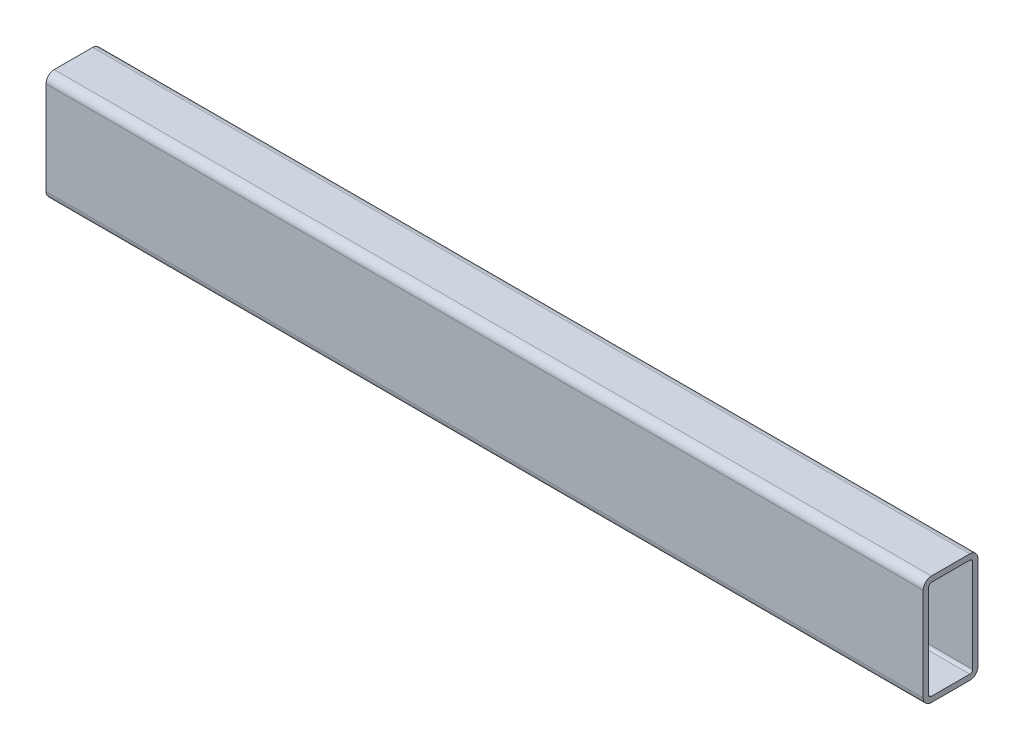
ISO-10303-21;
HEADER;
FILE_DESCRIPTION(('STEP AP214'),'2;1');
FILE_NAME('part.step','',(''),(''),'','','');
FILE_SCHEMA(('AUTOMOTIVE_DESIGN { 1 0 10303 214 1 1 1 1 }'));
ENDSEC;
DATA;
#1=APPLICATION_CONTEXT('core data for automotive mechanical design processes');
#2=APPLICATION_PROTOCOL_DEFINITION('international standard','automotive_design',2000,#1);
#3=PRODUCT_CONTEXT('',#1,'mechanical');
#4=PRODUCT('Part','Part','',(#3));
#5=PRODUCT_RELATED_PRODUCT_CATEGORY('part','',(#4));
#6=PRODUCT_DEFINITION_FORMATION('','',#4);
#7=PRODUCT_DEFINITION_CONTEXT('part definition',#1,'design');
#8=PRODUCT_DEFINITION('design','',#6,#7);
#9=PRODUCT_DEFINITION_SHAPE('','',#8);
#10=(LENGTH_UNIT() NAMED_UNIT(*) SI_UNIT(.MILLI.,.METRE.));
#11=(NAMED_UNIT(*) PLANE_ANGLE_UNIT() SI_UNIT($,.RADIAN.));
#12=(NAMED_UNIT(*) SI_UNIT($,.STERADIAN.) SOLID_ANGLE_UNIT());
#13=UNCERTAINTY_MEASURE_WITH_UNIT(LENGTH_MEASURE(1.E-05),#10,'distance_accuracy_value','');
#14=(GEOMETRIC_REPRESENTATION_CONTEXT(3) GLOBAL_UNCERTAINTY_ASSIGNED_CONTEXT((#13)) GLOBAL_UNIT_ASSIGNED_CONTEXT((#10,
#11,#12)) REPRESENTATION_CONTEXT('',''));
#15=CARTESIAN_POINT('',(0.,0.,0.));
#16=DIRECTION('',(0.,0.,1.));
#17=DIRECTION('',(1.,0.,0.));
#18=AXIS2_PLACEMENT_3D('',#15,#16,#17);
#19=CARTESIAN_POINT('',(320.,1.,-1.));
#20=DIRECTION('',(-1.,0.,0.));
#21=DIRECTION('',(0.,0.,1.));
#22=AXIS2_PLACEMENT_3D('',#19,#20,#21);
#23=PLANE('',#22);
#24=CARTESIAN_POINT('',(320.,1.,-1.));
#25=DIRECTION('',(-1.,0.,0.));
#26=DIRECTION('',(0.,0.,1.));
#27=AXIS2_PLACEMENT_3D('',#24,#25,#26);
#28=CIRCLE('',#27,3.);
#29=CARTESIAN_POINT('',(320.,1.,2.));
#30=VERTEX_POINT('',#29);
#31=CARTESIAN_POINT('',(320.,-2.,-1.));
#32=VERTEX_POINT('',#31);
#33=EDGE_CURVE('E261',#30,#32,#28,.F.);
#34=ORIENTED_EDGE('',*,*,#33,.T.);
#35=DIRECTION('',(0.,0.,-1.));
#36=VECTOR('',#35,1.);
#37=CARTESIAN_POINT('',(320.,-2.,-1.));
#38=LINE('',#37,#36);
#39=CARTESIAN_POINT('',(320.,-2.,-15.));
#40=VERTEX_POINT('',#39);
#41=EDGE_CURVE('E264',#32,#40,#38,.T.);
#42=ORIENTED_EDGE('',*,*,#41,.T.);
#43=CARTESIAN_POINT('',(320.,1.,-15.));
#44=DIRECTION('',(-1.,0.,0.));
#45=DIRECTION('',(0.,0.,1.));
#46=AXIS2_PLACEMENT_3D('',#43,#44,#45);
#47=CIRCLE('',#46,3.);
#48=CARTESIAN_POINT('',(320.,1.,-18.));
#49=VERTEX_POINT('',#48);
#50=EDGE_CURVE('E267',#40,#49,#47,.F.);
#51=ORIENTED_EDGE('',*,*,#50,.T.);
#52=DIRECTION('',(0.,1.,0.));
#53=VECTOR('',#52,1.);
#54=CARTESIAN_POINT('',(320.,1.,-18.));
#55=LINE('',#54,#53);
#56=CARTESIAN_POINT('',(320.,35.,-18.));
#57=VERTEX_POINT('',#56);
#58=EDGE_CURVE('E269',#49,#57,#55,.T.);
#59=ORIENTED_EDGE('',*,*,#58,.T.);
#60=CARTESIAN_POINT('',(320.,35.,-15.));
#61=DIRECTION('',(-1.,0.,0.));
#62=DIRECTION('',(0.,0.,1.));
#63=AXIS2_PLACEMENT_3D('',#60,#61,#62);
#64=CIRCLE('',#63,3.);
#65=CARTESIAN_POINT('',(320.,38.,-15.));
#66=VERTEX_POINT('',#65);
#67=EDGE_CURVE('E271',#57,#66,#64,.F.);
#68=ORIENTED_EDGE('',*,*,#67,.T.);
#69=DIRECTION('',(0.,0.,1.));
#70=VECTOR('',#69,1.);
#71=CARTESIAN_POINT('',(320.,38.,-1.));
#72=LINE('',#71,#70);
#73=CARTESIAN_POINT('',(320.,38.,-1.));
#74=VERTEX_POINT('',#73);
#75=EDGE_CURVE('E273',#66,#74,#72,.T.);
#76=ORIENTED_EDGE('',*,*,#75,.T.);
#77=CARTESIAN_POINT('',(320.,35.,-1.));
#78=DIRECTION('',(-1.,0.,0.));
#79=DIRECTION('',(0.,0.,1.));
#80=AXIS2_PLACEMENT_3D('',#77,#78,#79);
#81=CIRCLE('',#80,3.);
#82=CARTESIAN_POINT('',(320.,35.,2.));
#83=VERTEX_POINT('',#82);
#84=EDGE_CURVE('E275',#74,#83,#81,.F.);
#85=ORIENTED_EDGE('',*,*,#84,.T.);
#86=DIRECTION('',(0.,-1.,0.));
#87=VECTOR('',#86,1.);
#88=CARTESIAN_POINT('',(320.,1.,2.));
#89=LINE('',#88,#87);
#90=EDGE_CURVE('E277',#83,#30,#89,.T.);
#91=ORIENTED_EDGE('',*,*,#90,.T.);
#92=EDGE_LOOP('',(#34,#42,#51,#59,#68,#76,#85,#91));
#93=FACE_BOUND('',#92,.T.);
#94=CARTESIAN_POINT('',(320.,1.,-1.));
#95=DIRECTION('',(1.,0.,0.));
#96=DIRECTION('',(0.,0.,1.));
#97=AXIS2_PLACEMENT_3D('',#94,#95,#96);
#98=CIRCLE('',#97,1.);
#99=CARTESIAN_POINT('',(320.,1.,0.));
#100=VERTEX_POINT('',#99);
#101=CARTESIAN_POINT('',(320.,0.,-1.));
#102=VERTEX_POINT('',#101);
#103=EDGE_CURVE('E196',#100,#102,#98,.T.);
#104=ORIENTED_EDGE('',*,*,#103,.F.);
#105=DIRECTION('',(0.,-1.,0.));
#106=VECTOR('',#105,1.);
#107=CARTESIAN_POINT('',(320.,1.,0.));
#108=LINE('',#107,#106);
#109=CARTESIAN_POINT('',(320.,35.,0.));
#110=VERTEX_POINT('',#109);
#111=EDGE_CURVE('E229',#110,#100,#108,.T.);
#112=ORIENTED_EDGE('',*,*,#111,.F.);
#113=CARTESIAN_POINT('',(320.,35.,-1.));
#114=DIRECTION('',(1.,0.,0.));
#115=DIRECTION('',(0.,0.,1.));
#116=AXIS2_PLACEMENT_3D('',#113,#114,#115);
#117=CIRCLE('',#116,1.);
#118=CARTESIAN_POINT('',(320.,36.,-1.));
#119=VERTEX_POINT('',#118);
#120=EDGE_CURVE('E227',#119,#110,#117,.T.);
#121=ORIENTED_EDGE('',*,*,#120,.F.);
#122=DIRECTION('',(0.,0.,1.));
#123=VECTOR('',#122,1.);
#124=CARTESIAN_POINT('',(320.,36.,-1.));
#125=LINE('',#124,#123);
#126=CARTESIAN_POINT('',(320.,36.,-15.));
#127=VERTEX_POINT('',#126);
#128=EDGE_CURVE('E225',#127,#119,#125,.T.);
#129=ORIENTED_EDGE('',*,*,#128,.F.);
#130=CARTESIAN_POINT('',(320.,35.,-15.));
#131=DIRECTION('',(1.,0.,0.));
#132=DIRECTION('',(0.,0.,-1.));
#133=AXIS2_PLACEMENT_3D('',#130,#131,#132);
#134=CIRCLE('',#133,0.999999999999999);
#135=CARTESIAN_POINT('',(320.,35.,-16.));
#136=VERTEX_POINT('',#135);
#137=EDGE_CURVE('E223',#136,#127,#134,.T.);
#138=ORIENTED_EDGE('',*,*,#137,.F.);
#139=DIRECTION('',(0.,1.,0.));
#140=VECTOR('',#139,1.);
#141=CARTESIAN_POINT('',(320.,1.,-16.));
#142=LINE('',#141,#140);
#143=CARTESIAN_POINT('',(320.,1.,-16.));
#144=VERTEX_POINT('',#143);
#145=EDGE_CURVE('E219',#144,#136,#142,.T.);
#146=ORIENTED_EDGE('',*,*,#145,.F.);
#147=CARTESIAN_POINT('',(320.,1.,-15.));
#148=DIRECTION('',(1.,0.,0.));
#149=DIRECTION('',(0.,0.,-1.));
#150=AXIS2_PLACEMENT_3D('',#147,#148,#149);
#151=CIRCLE('',#150,1.);
#152=CARTESIAN_POINT('',(320.,0.,-15.));
#153=VERTEX_POINT('',#152);
#154=EDGE_CURVE('E217',#153,#144,#151,.T.);
#155=ORIENTED_EDGE('',*,*,#154,.F.);
#156=DIRECTION('',(0.,0.,-1.));
#157=VECTOR('',#156,1.);
#158=CARTESIAN_POINT('',(320.,0.,-1.));
#159=LINE('',#158,#157);
#160=EDGE_CURVE('E204',#102,#153,#159,.T.);
#161=ORIENTED_EDGE('',*,*,#160,.F.);
#162=EDGE_LOOP('',(#104,#112,#121,#129,#138,#146,#155,#161));
#163=FACE_BOUND('',#162,.T.);
#164=ADVANCED_FACE('F83',(#93,#163),#23,.F.);
#165=CARTESIAN_POINT('',(0.,1.,-1.));
#166=DIRECTION('',(-1.,0.,0.));
#167=DIRECTION('',(0.,0.,1.));
#168=AXIS2_PLACEMENT_3D('',#165,#166,#167);
#169=PLANE('',#168);
#170=CARTESIAN_POINT('',(0.,1.,-1.));
#171=DIRECTION('',(-1.,0.,0.));
#172=DIRECTION('',(0.,0.,1.));
#173=AXIS2_PLACEMENT_3D('',#170,#171,#172);
#174=CIRCLE('',#173,3.);
#175=CARTESIAN_POINT('',(0.,1.,2.));
#176=VERTEX_POINT('',#175);
#177=CARTESIAN_POINT('',(0.,-2.,-1.));
#178=VERTEX_POINT('',#177);
#179=EDGE_CURVE('E212',#176,#178,#174,.F.);
#180=ORIENTED_EDGE('',*,*,#179,.F.);
#181=DIRECTION('',(0.,-1.,0.));
#182=VECTOR('',#181,1.);
#183=CARTESIAN_POINT('',(0.,1.,2.));
#184=LINE('',#183,#182);
#185=CARTESIAN_POINT('',(0.,35.,2.));
#186=VERTEX_POINT('',#185);
#187=EDGE_CURVE('E265',#186,#176,#184,.T.);
#188=ORIENTED_EDGE('',*,*,#187,.F.);
#189=CARTESIAN_POINT('',(0.,35.,-1.));
#190=DIRECTION('',(-1.,0.,0.));
#191=DIRECTION('',(0.,0.,1.));
#192=AXIS2_PLACEMENT_3D('',#189,#190,#191);
#193=CIRCLE('',#192,3.);
#194=CARTESIAN_POINT('',(0.,38.,-1.));
#195=VERTEX_POINT('',#194);
#196=EDGE_CURVE('E292',#195,#186,#193,.F.);
#197=ORIENTED_EDGE('',*,*,#196,.F.);
#198=DIRECTION('',(0.,0.,1.));
#199=VECTOR('',#198,1.);
#200=CARTESIAN_POINT('',(0.,38.,-1.));
#201=LINE('',#200,#199);
#202=CARTESIAN_POINT('',(0.,38.,-15.));
#203=VERTEX_POINT('',#202);
#204=EDGE_CURVE('E290',#203,#195,#201,.T.);
#205=ORIENTED_EDGE('',*,*,#204,.F.);
#206=CARTESIAN_POINT('',(0.,35.,-15.));
#207=DIRECTION('',(-1.,0.,0.));
#208=DIRECTION('',(0.,0.,1.));
#209=AXIS2_PLACEMENT_3D('',#206,#207,#208);
#210=CIRCLE('',#209,3.);
#211=CARTESIAN_POINT('',(0.,35.,-18.));
#212=VERTEX_POINT('',#211);
#213=EDGE_CURVE('E288',#212,#203,#210,.F.);
#214=ORIENTED_EDGE('',*,*,#213,.F.);
#215=DIRECTION('',(0.,1.,0.));
#216=VECTOR('',#215,1.);
#217=CARTESIAN_POINT('',(0.,1.,-18.));
#218=LINE('',#217,#216);
#219=CARTESIAN_POINT('',(0.,1.,-18.));
#220=VERTEX_POINT('',#219);
#221=EDGE_CURVE('E286',#220,#212,#218,.T.);
#222=ORIENTED_EDGE('',*,*,#221,.F.);
#223=CARTESIAN_POINT('',(0.,1.,-15.));
#224=DIRECTION('',(-1.,0.,0.));
#225=DIRECTION('',(0.,0.,1.));
#226=AXIS2_PLACEMENT_3D('',#223,#224,#225);
#227=CIRCLE('',#226,3.);
#228=CARTESIAN_POINT('',(0.,-2.,-15.));
#229=VERTEX_POINT('',#228);
#230=EDGE_CURVE('E284',#229,#220,#227,.F.);
#231=ORIENTED_EDGE('',*,*,#230,.F.);
#232=DIRECTION('',(0.,0.,-1.));
#233=VECTOR('',#232,1.);
#234=CARTESIAN_POINT('',(0.,-2.,-1.));
#235=LINE('',#234,#233);
#236=EDGE_CURVE('E282',#178,#229,#235,.T.);
#237=ORIENTED_EDGE('',*,*,#236,.F.);
#238=EDGE_LOOP('',(#180,#188,#197,#205,#214,#222,#231,#237));
#239=FACE_BOUND('',#238,.T.);
#240=DIRECTION('',(0.,-1.,0.));
#241=VECTOR('',#240,1.);
#242=CARTESIAN_POINT('',(0.,1.,0.));
#243=LINE('',#242,#241);
#244=CARTESIAN_POINT('',(0.,35.,0.));
#245=VERTEX_POINT('',#244);
#246=CARTESIAN_POINT('',(0.,1.,0.));
#247=VERTEX_POINT('',#246);
#248=EDGE_CURVE('E205',#245,#247,#243,.T.);
#249=ORIENTED_EDGE('',*,*,#248,.T.);
#250=CARTESIAN_POINT('',(0.,1.,-1.));
#251=DIRECTION('',(1.,0.,0.));
#252=DIRECTION('',(0.,0.,1.));
#253=AXIS2_PLACEMENT_3D('',#250,#251,#252);
#254=CIRCLE('',#253,1.);
#255=CARTESIAN_POINT('',(0.,0.,-1.));
#256=VERTEX_POINT('',#255);
#257=EDGE_CURVE('E106',#247,#256,#254,.T.);
#258=ORIENTED_EDGE('',*,*,#257,.T.);
#259=DIRECTION('',(0.,0.,-1.));
#260=VECTOR('',#259,1.);
#261=CARTESIAN_POINT('',(0.,0.,-1.));
#262=LINE('',#261,#260);
#263=CARTESIAN_POINT('',(0.,0.,-15.));
#264=VERTEX_POINT('',#263);
#265=EDGE_CURVE('E211',#256,#264,#262,.T.);
#266=ORIENTED_EDGE('',*,*,#265,.T.);
#267=CARTESIAN_POINT('',(0.,1.,-15.));
#268=DIRECTION('',(1.,0.,0.));
#269=DIRECTION('',(0.,0.,-1.));
#270=AXIS2_PLACEMENT_3D('',#267,#268,#269);
#271=CIRCLE('',#270,1.);
#272=CARTESIAN_POINT('',(0.,1.,-16.));
#273=VERTEX_POINT('',#272);
#274=EDGE_CURVE('E233',#264,#273,#271,.T.);
#275=ORIENTED_EDGE('',*,*,#274,.T.);
#276=DIRECTION('',(0.,1.,0.));
#277=VECTOR('',#276,1.);
#278=CARTESIAN_POINT('',(0.,1.,-16.));
#279=LINE('',#278,#277);
#280=CARTESIAN_POINT('',(0.,35.,-16.));
#281=VERTEX_POINT('',#280);
#282=EDGE_CURVE('E236',#273,#281,#279,.T.);
#283=ORIENTED_EDGE('',*,*,#282,.T.);
#284=CARTESIAN_POINT('',(0.,35.,-15.));
#285=DIRECTION('',(1.,0.,0.));
#286=DIRECTION('',(0.,0.,-1.));
#287=AXIS2_PLACEMENT_3D('',#284,#285,#286);
#288=CIRCLE('',#287,0.999999999999999);
#289=CARTESIAN_POINT('',(0.,36.,-15.));
#290=VERTEX_POINT('',#289);
#291=EDGE_CURVE('E239',#281,#290,#288,.T.);
#292=ORIENTED_EDGE('',*,*,#291,.T.);
#293=DIRECTION('',(0.,0.,1.));
#294=VECTOR('',#293,1.);
#295=CARTESIAN_POINT('',(0.,36.,-1.));
#296=LINE('',#295,#294);
#297=CARTESIAN_POINT('',(0.,36.,-1.));
#298=VERTEX_POINT('',#297);
#299=EDGE_CURVE('E242',#290,#298,#296,.T.);
#300=ORIENTED_EDGE('',*,*,#299,.T.);
#301=CARTESIAN_POINT('',(0.,35.,-1.));
#302=DIRECTION('',(1.,0.,0.));
#303=DIRECTION('',(0.,0.,1.));
#304=AXIS2_PLACEMENT_3D('',#301,#302,#303);
#305=CIRCLE('',#304,1.);
#306=EDGE_CURVE('E245',#298,#245,#305,.T.);
#307=ORIENTED_EDGE('',*,*,#306,.T.);
#308=EDGE_LOOP('',(#249,#258,#266,#275,#283,#292,#300,#307));
#309=FACE_BOUND('',#308,.T.);
#310=ADVANCED_FACE('F322',(#239,#309),#169,.T.);
#311=CARTESIAN_POINT('',(320.,1.,-1.));
#312=DIRECTION('',(-1.,0.,0.));
#313=DIRECTION('',(0.,0.,1.));
#314=AXIS2_PLACEMENT_3D('',#311,#312,#313);
#315=CYLINDRICAL_SURFACE('',#314,3.);
#316=ORIENTED_EDGE('',*,*,#179,.T.);
#317=DIRECTION('',(-1.,0.,0.));
#318=VECTOR('',#317,1.);
#319=CARTESIAN_POINT('',(320.,-2.,-1.));
#320=LINE('',#319,#318);
#321=EDGE_CURVE('E12',#32,#178,#320,.T.);
#322=ORIENTED_EDGE('',*,*,#321,.F.);
#323=ORIENTED_EDGE('',*,*,#33,.F.);
#324=DIRECTION('',(-1.,0.,0.));
#325=VECTOR('',#324,1.);
#326=CARTESIAN_POINT('',(320.,1.,2.));
#327=LINE('',#326,#325);
#328=EDGE_CURVE('E279',#30,#176,#327,.T.);
#329=ORIENTED_EDGE('',*,*,#328,.T.);
#330=EDGE_LOOP('',(#316,#322,#323,#329));
#331=FACE_BOUND('',#330,.T.);
#332=ADVANCED_FACE('F85',(#331),#315,.T.);
#333=CARTESIAN_POINT('',(320.,-2.,-1.));
#334=DIRECTION('',(0.,1.,0.));
#335=DIRECTION('',(0.,0.,1.));
#336=AXIS2_PLACEMENT_3D('',#333,#334,#335);
#337=PLANE('',#336);
#338=ORIENTED_EDGE('',*,*,#236,.T.);
#339=DIRECTION('',(-1.,0.,0.));
#340=VECTOR('',#339,1.);
#341=CARTESIAN_POINT('',(320.,-2.,-15.));
#342=LINE('',#341,#340);
#343=EDGE_CURVE('E91',#40,#229,#342,.T.);
#344=ORIENTED_EDGE('',*,*,#343,.F.);
#345=ORIENTED_EDGE('',*,*,#41,.F.);
#346=ORIENTED_EDGE('',*,*,#321,.T.);
#347=EDGE_LOOP('',(#338,#344,#345,#346));
#348=FACE_BOUND('',#347,.T.);
#349=ADVANCED_FACE('F339',(#348),#337,.F.);
#350=CARTESIAN_POINT('',(320.,1.,-15.));
#351=DIRECTION('',(-1.,0.,0.));
#352=DIRECTION('',(0.,0.,1.));
#353=AXIS2_PLACEMENT_3D('',#350,#351,#352);
#354=CYLINDRICAL_SURFACE('',#353,3.);
#355=ORIENTED_EDGE('',*,*,#230,.T.);
#356=DIRECTION('',(-1.,0.,0.));
#357=VECTOR('',#356,1.);
#358=CARTESIAN_POINT('',(320.,1.,-18.));
#359=LINE('',#358,#357);
#360=EDGE_CURVE('E309',#49,#220,#359,.T.);
#361=ORIENTED_EDGE('',*,*,#360,.F.);
#362=ORIENTED_EDGE('',*,*,#50,.F.);
#363=ORIENTED_EDGE('',*,*,#343,.T.);
#364=EDGE_LOOP('',(#355,#361,#362,#363));
#365=FACE_BOUND('',#364,.T.);
#366=ADVANCED_FACE('F316',(#365),#354,.T.);
#367=CARTESIAN_POINT('',(320.,1.,-18.));
#368=DIRECTION('',(0.,0.,1.));
#369=DIRECTION('',(0.,-1.,0.));
#370=AXIS2_PLACEMENT_3D('',#367,#368,#369);
#371=PLANE('',#370);
#372=ORIENTED_EDGE('',*,*,#221,.T.);
#373=DIRECTION('',(-1.,0.,0.));
#374=VECTOR('',#373,1.);
#375=CARTESIAN_POINT('',(320.,35.,-18.));
#376=LINE('',#375,#374);
#377=EDGE_CURVE('E306',#57,#212,#376,.T.);
#378=ORIENTED_EDGE('',*,*,#377,.F.);
#379=ORIENTED_EDGE('',*,*,#58,.F.);
#380=ORIENTED_EDGE('',*,*,#360,.T.);
#381=EDGE_LOOP('',(#372,#378,#379,#380));
#382=FACE_BOUND('',#381,.T.);
#383=ADVANCED_FACE('F328',(#382),#371,.F.);
#384=CARTESIAN_POINT('',(320.,35.,-15.));
#385=DIRECTION('',(-1.,0.,0.));
#386=DIRECTION('',(0.,0.,1.));
#387=AXIS2_PLACEMENT_3D('',#384,#385,#386);
#388=CYLINDRICAL_SURFACE('',#387,3.);
#389=ORIENTED_EDGE('',*,*,#213,.T.);
#390=DIRECTION('',(-1.,0.,0.));
#391=VECTOR('',#390,1.);
#392=CARTESIAN_POINT('',(320.,38.,-15.));
#393=LINE('',#392,#391);
#394=EDGE_CURVE('E303',#66,#203,#393,.T.);
#395=ORIENTED_EDGE('',*,*,#394,.F.);
#396=ORIENTED_EDGE('',*,*,#67,.F.);
#397=ORIENTED_EDGE('',*,*,#377,.T.);
#398=EDGE_LOOP('',(#389,#395,#396,#397));
#399=FACE_BOUND('',#398,.T.);
#400=ADVANCED_FACE('F332',(#399),#388,.T.);
#401=CARTESIAN_POINT('',(320.,38.,-1.));
#402=DIRECTION('',(0.,-1.,0.));
#403=DIRECTION('',(0.,0.,-1.));
#404=AXIS2_PLACEMENT_3D('',#401,#402,#403);
#405=PLANE('',#404);
#406=ORIENTED_EDGE('',*,*,#204,.T.);
#407=DIRECTION('',(-1.,0.,0.));
#408=VECTOR('',#407,1.);
#409=CARTESIAN_POINT('',(320.,38.,-1.));
#410=LINE('',#409,#408);
#411=EDGE_CURVE('E300',#74,#195,#410,.T.);
#412=ORIENTED_EDGE('',*,*,#411,.F.);
#413=ORIENTED_EDGE('',*,*,#75,.F.);
#414=ORIENTED_EDGE('',*,*,#394,.T.);
#415=EDGE_LOOP('',(#406,#412,#413,#414));
#416=FACE_BOUND('',#415,.T.);
#417=ADVANCED_FACE('F352',(#416),#405,.F.);
#418=CARTESIAN_POINT('',(320.,35.,-1.));
#419=DIRECTION('',(-1.,0.,0.));
#420=DIRECTION('',(0.,0.,1.));
#421=AXIS2_PLACEMENT_3D('',#418,#419,#420);
#422=CYLINDRICAL_SURFACE('',#421,3.);
#423=ORIENTED_EDGE('',*,*,#196,.T.);
#424=DIRECTION('',(-1.,0.,0.));
#425=VECTOR('',#424,1.);
#426=CARTESIAN_POINT('',(320.,35.,2.));
#427=LINE('',#426,#425);
#428=EDGE_CURVE('E297',#83,#186,#427,.T.);
#429=ORIENTED_EDGE('',*,*,#428,.F.);
#430=ORIENTED_EDGE('',*,*,#84,.F.);
#431=ORIENTED_EDGE('',*,*,#411,.T.);
#432=EDGE_LOOP('',(#423,#429,#430,#431));
#433=FACE_BOUND('',#432,.T.);
#434=ADVANCED_FACE('F350',(#433),#422,.T.);
#435=CARTESIAN_POINT('',(320.,1.,2.));
#436=DIRECTION('',(0.,0.,-1.));
#437=DIRECTION('',(-1.,0.,0.));
#438=AXIS2_PLACEMENT_3D('',#435,#436,#437);
#439=PLANE('',#438);
#440=ORIENTED_EDGE('',*,*,#187,.T.);
#441=ORIENTED_EDGE('',*,*,#328,.F.);
#442=ORIENTED_EDGE('',*,*,#90,.F.);
#443=ORIENTED_EDGE('',*,*,#428,.T.);
#444=EDGE_LOOP('',(#440,#441,#442,#443));
#445=FACE_BOUND('',#444,.T.);
#446=ADVANCED_FACE('F345',(#445),#439,.F.);
#447=CARTESIAN_POINT('',(320.,1.,-1.));
#448=DIRECTION('',(-1.,0.,0.));
#449=DIRECTION('',(0.,0.,1.));
#450=AXIS2_PLACEMENT_3D('',#447,#448,#449);
#451=CYLINDRICAL_SURFACE('',#450,1.);
#452=ORIENTED_EDGE('',*,*,#257,.F.);
#453=DIRECTION('',(-1.,0.,0.));
#454=VECTOR('',#453,1.);
#455=CARTESIAN_POINT('',(320.,1.,0.));
#456=LINE('',#455,#454);
#457=EDGE_CURVE('E200',#100,#247,#456,.T.);
#458=ORIENTED_EDGE('',*,*,#457,.F.);
#459=ORIENTED_EDGE('',*,*,#103,.T.);
#460=DIRECTION('',(-1.,0.,0.));
#461=VECTOR('',#460,1.);
#462=CARTESIAN_POINT('',(320.,0.,-1.));
#463=LINE('',#462,#461);
#464=EDGE_CURVE('E199',#102,#256,#463,.T.);
#465=ORIENTED_EDGE('',*,*,#464,.T.);
#466=EDGE_LOOP('',(#452,#458,#459,#465));
#467=FACE_BOUND('',#466,.T.);
#468=ADVANCED_FACE('F198',(#467),#451,.F.);
#469=CARTESIAN_POINT('',(320.,0.,-1.));
#470=DIRECTION('',(0.,1.,0.));
#471=DIRECTION('',(0.,0.,1.));
#472=AXIS2_PLACEMENT_3D('',#469,#470,#471);
#473=PLANE('',#472);
#474=ORIENTED_EDGE('',*,*,#265,.F.);
#475=ORIENTED_EDGE('',*,*,#464,.F.);
#476=ORIENTED_EDGE('',*,*,#160,.T.);
#477=DIRECTION('',(-1.,0.,0.));
#478=VECTOR('',#477,1.);
#479=CARTESIAN_POINT('',(320.,0.,-15.));
#480=LINE('',#479,#478);
#481=EDGE_CURVE('E213',#153,#264,#480,.T.);
#482=ORIENTED_EDGE('',*,*,#481,.T.);
#483=EDGE_LOOP('',(#474,#475,#476,#482));
#484=FACE_BOUND('',#483,.T.);
#485=ADVANCED_FACE('F208',(#484),#473,.T.);
#486=CARTESIAN_POINT('',(320.,1.,-15.));
#487=DIRECTION('',(-1.,0.,0.));
#488=DIRECTION('',(0.,0.,1.));
#489=AXIS2_PLACEMENT_3D('',#486,#487,#488);
#490=CYLINDRICAL_SURFACE('',#489,1.);
#491=ORIENTED_EDGE('',*,*,#274,.F.);
#492=ORIENTED_EDGE('',*,*,#481,.F.);
#493=ORIENTED_EDGE('',*,*,#154,.T.);
#494=DIRECTION('',(-1.,0.,0.));
#495=VECTOR('',#494,1.);
#496=CARTESIAN_POINT('',(320.,1.,-16.));
#497=LINE('',#496,#495);
#498=EDGE_CURVE('E258',#144,#273,#497,.T.);
#499=ORIENTED_EDGE('',*,*,#498,.T.);
#500=EDGE_LOOP('',(#491,#492,#493,#499));
#501=FACE_BOUND('',#500,.T.);
#502=ADVANCED_FACE('F377',(#501),#490,.F.);
#503=CARTESIAN_POINT('',(320.,1.,-16.));
#504=DIRECTION('',(0.,0.,1.));
#505=DIRECTION('',(0.,-1.,0.));
#506=AXIS2_PLACEMENT_3D('',#503,#504,#505);
#507=PLANE('',#506);
#508=ORIENTED_EDGE('',*,*,#282,.F.);
#509=ORIENTED_EDGE('',*,*,#498,.F.);
#510=ORIENTED_EDGE('',*,*,#145,.T.);
#511=DIRECTION('',(-1.,0.,0.));
#512=VECTOR('',#511,1.);
#513=CARTESIAN_POINT('',(320.,35.,-16.));
#514=LINE('',#513,#512);
#515=EDGE_CURVE('E256',#136,#281,#514,.T.);
#516=ORIENTED_EDGE('',*,*,#515,.T.);
#517=EDGE_LOOP('',(#508,#509,#510,#516));
#518=FACE_BOUND('',#517,.T.);
#519=ADVANCED_FACE('F381',(#518),#507,.T.);
#520=CARTESIAN_POINT('',(320.,35.,-15.));
#521=DIRECTION('',(-1.,0.,0.));
#522=DIRECTION('',(0.,0.,1.));
#523=AXIS2_PLACEMENT_3D('',#520,#521,#522);
#524=CYLINDRICAL_SURFACE('',#523,0.999999999999999);
#525=ORIENTED_EDGE('',*,*,#291,.F.);
#526=ORIENTED_EDGE('',*,*,#515,.F.);
#527=ORIENTED_EDGE('',*,*,#137,.T.);
#528=DIRECTION('',(-1.,0.,0.));
#529=VECTOR('',#528,1.);
#530=CARTESIAN_POINT('',(320.,36.,-15.));
#531=LINE('',#530,#529);
#532=EDGE_CURVE('E254',#127,#290,#531,.T.);
#533=ORIENTED_EDGE('',*,*,#532,.T.);
#534=EDGE_LOOP('',(#525,#526,#527,#533));
#535=FACE_BOUND('',#534,.T.);
#536=ADVANCED_FACE('F387',(#535),#524,.F.);
#537=CARTESIAN_POINT('',(320.,36.,-1.));
#538=DIRECTION('',(0.,-1.,0.));
#539=DIRECTION('',(0.,0.,-1.));
#540=AXIS2_PLACEMENT_3D('',#537,#538,#539);
#541=PLANE('',#540);
#542=ORIENTED_EDGE('',*,*,#299,.F.);
#543=ORIENTED_EDGE('',*,*,#532,.F.);
#544=ORIENTED_EDGE('',*,*,#128,.T.);
#545=DIRECTION('',(-1.,0.,0.));
#546=VECTOR('',#545,1.);
#547=CARTESIAN_POINT('',(320.,36.,-1.));
#548=LINE('',#547,#546);
#549=EDGE_CURVE('E252',#119,#298,#548,.T.);
#550=ORIENTED_EDGE('',*,*,#549,.T.);
#551=EDGE_LOOP('',(#542,#543,#544,#550));
#552=FACE_BOUND('',#551,.T.);
#553=ADVANCED_FACE('F391',(#552),#541,.T.);
#554=CARTESIAN_POINT('',(320.,35.,-1.));
#555=DIRECTION('',(-1.,0.,0.));
#556=DIRECTION('',(0.,0.,1.));
#557=AXIS2_PLACEMENT_3D('',#554,#555,#556);
#558=CYLINDRICAL_SURFACE('',#557,1.);
#559=ORIENTED_EDGE('',*,*,#306,.F.);
#560=ORIENTED_EDGE('',*,*,#549,.F.);
#561=ORIENTED_EDGE('',*,*,#120,.T.);
#562=DIRECTION('',(-1.,0.,0.));
#563=VECTOR('',#562,1.);
#564=CARTESIAN_POINT('',(320.,35.,0.));
#565=LINE('',#564,#563);
#566=EDGE_CURVE('E98',#110,#245,#565,.T.);
#567=ORIENTED_EDGE('',*,*,#566,.T.);
#568=EDGE_LOOP('',(#559,#560,#561,#567));
#569=FACE_BOUND('',#568,.T.);
#570=ADVANCED_FACE('F395',(#569),#558,.F.);
#571=CARTESIAN_POINT('',(320.,1.,0.));
#572=DIRECTION('',(0.,0.,-1.));
#573=DIRECTION('',(-1.,0.,0.));
#574=AXIS2_PLACEMENT_3D('',#571,#572,#573);
#575=PLANE('',#574);
#576=ORIENTED_EDGE('',*,*,#248,.F.);
#577=ORIENTED_EDGE('',*,*,#566,.F.);
#578=ORIENTED_EDGE('',*,*,#111,.T.);
#579=ORIENTED_EDGE('',*,*,#457,.T.);
#580=EDGE_LOOP('',(#576,#577,#578,#579));
#581=FACE_BOUND('',#580,.T.);
#582=ADVANCED_FACE('F399',(#581),#575,.T.);
#583=CLOSED_SHELL('',(#164,#310,#332,#349,#366,#383,#400,#417,#434,#446,#468,#485,#502,#519,
#536,#553,#570,#582));
#584=MANIFOLD_SOLID_BREP('B2',#583);
#585=ADVANCED_BREP_SHAPE_REPRESENTATION('',(#18,#584),#14);
#586=SHAPE_DEFINITION_REPRESENTATION(#9,#585);
ENDSEC;
END-ISO-10303-21;
